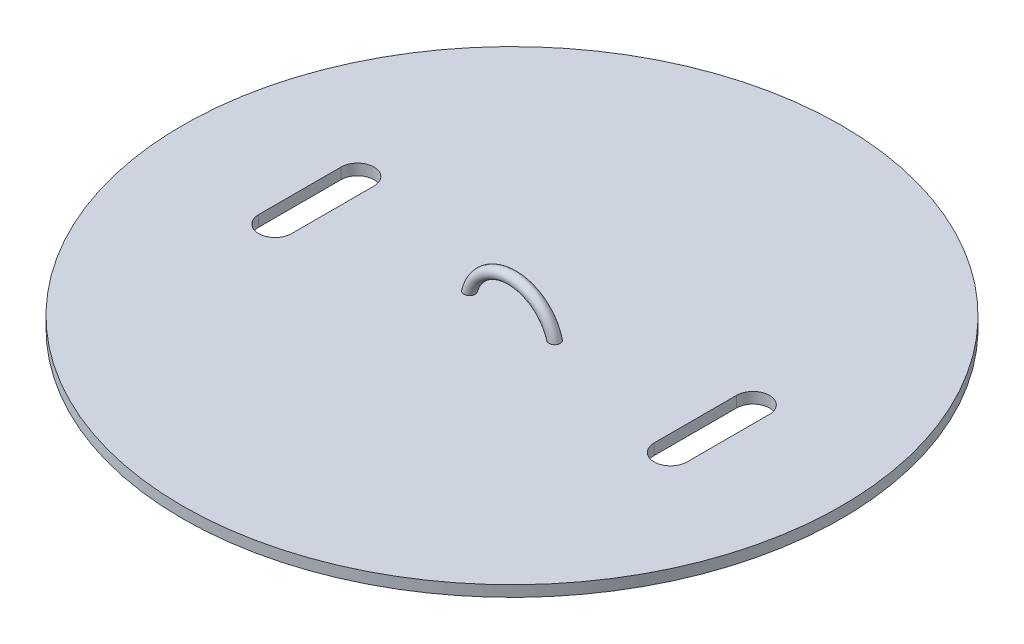
ISO-10303-21;
HEADER;
FILE_DESCRIPTION(('STEP AP214'),'2;1');
FILE_NAME('part.step','',(''),(''),'','','');
FILE_SCHEMA(('AUTOMOTIVE_DESIGN { 1 0 10303 214 1 1 1 1 }'));
ENDSEC;
DATA;
#1=APPLICATION_CONTEXT('core data for automotive mechanical design processes');
#2=APPLICATION_PROTOCOL_DEFINITION('international standard','automotive_design',2000,#1);
#3=PRODUCT_CONTEXT('',#1,'mechanical');
#4=PRODUCT('Part','Part','',(#3));
#5=PRODUCT_RELATED_PRODUCT_CATEGORY('part','',(#4));
#6=PRODUCT_DEFINITION_FORMATION('','',#4);
#7=PRODUCT_DEFINITION_CONTEXT('part definition',#1,'design');
#8=PRODUCT_DEFINITION('design','',#6,#7);
#9=PRODUCT_DEFINITION_SHAPE('','',#8);
#10=(LENGTH_UNIT() NAMED_UNIT(*) SI_UNIT(.MILLI.,.METRE.));
#11=(NAMED_UNIT(*) PLANE_ANGLE_UNIT() SI_UNIT($,.RADIAN.));
#12=(NAMED_UNIT(*) SI_UNIT($,.STERADIAN.) SOLID_ANGLE_UNIT());
#13=UNCERTAINTY_MEASURE_WITH_UNIT(LENGTH_MEASURE(1.E-05),#10,'distance_accuracy_value','');
#14=(GEOMETRIC_REPRESENTATION_CONTEXT(3) GLOBAL_UNCERTAINTY_ASSIGNED_CONTEXT((#13)) GLOBAL_UNIT_ASSIGNED_CONTEXT((#10,
#11,#12)) REPRESENTATION_CONTEXT('',''));
#15=CARTESIAN_POINT('',(0.,0.,0.));
#16=DIRECTION('',(0.,0.,1.));
#17=DIRECTION('',(1.,0.,0.));
#18=AXIS2_PLACEMENT_3D('',#15,#16,#17);
#19=CARTESIAN_POINT('',(0.,2.,137.725986214179));
#20=DIRECTION('',(0.,1.,0.));
#21=DIRECTION('',(0.,0.,1.));
#22=AXIS2_PLACEMENT_3D('',#19,#20,#21);
#23=PLANE('',#22);
#24=CARTESIAN_POINT('',(36.,2.,129.850097305786));
#25=DIRECTION('',(0.,1.,0.));
#26=DIRECTION('',(0.,0.,1.));
#27=AXIS2_PLACEMENT_3D('',#24,#25,#26);
#28=CIRCLE('',#27,3.);
#29=CARTESIAN_POINT('',(39.,2.,129.850097305786));
#30=VERTEX_POINT('',#29);
#31=CARTESIAN_POINT('',(33.,2.,129.850097305786));
#32=VERTEX_POINT('',#31);
#33=EDGE_CURVE('E50',#30,#32,#28,.T.);
#34=ORIENTED_EDGE('',*,*,#33,.F.);
#35=DIRECTION('',(0.,0.,-1.));
#36=VECTOR('',#35,1.);
#37=CARTESIAN_POINT('',(39.,2.,129.850097305786));
#38=LINE('',#37,#36);
#39=CARTESIAN_POINT('',(39.,2.,144.850097305786));
#40=VERTEX_POINT('',#39);
#41=EDGE_CURVE('E123',#40,#30,#38,.T.);
#42=ORIENTED_EDGE('',*,*,#41,.F.);
#43=CARTESIAN_POINT('',(36.,2.,144.850097305786));
#44=DIRECTION('',(0.,1.,0.));
#45=DIRECTION('',(0.,0.,1.));
#46=AXIS2_PLACEMENT_3D('',#43,#44,#45);
#47=CIRCLE('',#46,3.);
#48=CARTESIAN_POINT('',(33.,2.,144.850097305786));
#49=VERTEX_POINT('',#48);
#50=EDGE_CURVE('E107',#49,#40,#47,.T.);
#51=ORIENTED_EDGE('',*,*,#50,.F.);
#52=DIRECTION('',(0.,0.,1.));
#53=VECTOR('',#52,1.);
#54=CARTESIAN_POINT('',(33.,2.,129.850097305786));
#55=LINE('',#54,#53);
#56=EDGE_CURVE('E117',#32,#49,#55,.T.);
#57=ORIENTED_EDGE('',*,*,#56,.F.);
#58=EDGE_LOOP('',(#34,#42,#51,#57));
#59=FACE_BOUND('',#58,.T.);
#60=CARTESIAN_POINT('',(-36.,2.,129.850097305786));
#61=DIRECTION('',(0.,1.,0.));
#62=DIRECTION('',(0.,0.,-1.));
#63=AXIS2_PLACEMENT_3D('',#60,#61,#62);
#64=CIRCLE('',#63,3.);
#65=CARTESIAN_POINT('',(-33.,2.,129.850097305786));
#66=VERTEX_POINT('',#65);
#67=CARTESIAN_POINT('',(-39.,2.,129.850097305786));
#68=VERTEX_POINT('',#67);
#69=EDGE_CURVE('E58',#66,#68,#64,.T.);
#70=ORIENTED_EDGE('',*,*,#69,.F.);
#71=DIRECTION('',(0.,0.,-1.));
#72=VECTOR('',#71,1.);
#73=CARTESIAN_POINT('',(-33.,2.,129.850097305786));
#74=LINE('',#73,#72);
#75=CARTESIAN_POINT('',(-33.,2.,144.850097305786));
#76=VERTEX_POINT('',#75);
#77=EDGE_CURVE('E140',#76,#66,#74,.T.);
#78=ORIENTED_EDGE('',*,*,#77,.F.);
#79=CARTESIAN_POINT('',(-36.,2.,144.850097305786));
#80=DIRECTION('',(0.,1.,0.));
#81=DIRECTION('',(0.,0.,-1.));
#82=AXIS2_PLACEMENT_3D('',#79,#80,#81);
#83=CIRCLE('',#82,3.);
#84=CARTESIAN_POINT('',(-39.,2.,144.850097305786));
#85=VERTEX_POINT('',#84);
#86=EDGE_CURVE('E137',#85,#76,#83,.T.);
#87=ORIENTED_EDGE('',*,*,#86,.F.);
#88=DIRECTION('',(0.,0.,1.));
#89=VECTOR('',#88,1.);
#90=CARTESIAN_POINT('',(-39.,2.,129.850097305786));
#91=LINE('',#90,#89);
#92=EDGE_CURVE('E134',#68,#85,#91,.T.);
#93=ORIENTED_EDGE('',*,*,#92,.F.);
#94=EDGE_LOOP('',(#70,#78,#87,#93));
#95=FACE_BOUND('',#94,.T.);
#96=CARTESIAN_POINT('',(6.7811488769525,2.,137.358591346434));
#97=CARTESIAN_POINT('',(6.80267469490522,2.,137.306332251775));
#98=CARTESIAN_POINT('',(6.82876437892914,2.,137.255898919187));
#99=CARTESIAN_POINT('',(6.88914822352741,2.,137.160143898287));
#100=CARTESIAN_POINT('',(6.92345565618152,2.,137.114830655224));
#101=CARTESIAN_POINT('',(6.99904799460352,2.,137.030635512573));
#102=CARTESIAN_POINT('',(7.04031790363851,2.,136.991740138138));
#103=CARTESIAN_POINT('',(7.12862316130927,2.,136.921209520824));
#104=CARTESIAN_POINT('',(7.17565710576878,2.,136.889572515107));
#105=CARTESIAN_POINT('',(7.27560300601597,2.,136.833460085979));
#106=CARTESIAN_POINT('',(7.32864479411864,2.,136.809215905615));
#107=CARTESIAN_POINT('',(7.4379779802226,2.,136.769707550683));
#108=CARTESIAN_POINT('',(7.49427003615429,2.,136.754445201296));
#109=CARTESIAN_POINT('',(7.61012410310729,2.,136.732984643997));
#110=CARTESIAN_POINT('',(7.66973332112787,2.,136.727040450831));
#111=CARTESIAN_POINT('',(7.78911116622871,2.,136.725188571014));
#112=CARTESIAN_POINT('',(7.84887980243135,2.,136.729281471582));
#113=CARTESIAN_POINT('',(7.96716444197752,2.,136.747496947115));
#114=CARTESIAN_POINT('',(8.02567318942763,2.,136.761666836477));
#115=CARTESIAN_POINT('',(8.13941835402063,2.,136.799784442725));
#116=CARTESIAN_POINT('',(8.19465498697862,2.,136.823731513924));
#117=CARTESIAN_POINT('',(8.29932815549681,2.,136.880367220211));
#118=CARTESIAN_POINT('',(8.34884238897097,2.,136.912912121802));
#119=CARTESIAN_POINT('',(8.44150943051888,2.,136.986065458279));
#120=CARTESIAN_POINT('',(8.48466314710946,2.,137.02667273961));
#121=CARTESIAN_POINT('',(8.56214814372743,2.,137.113641276871));
#122=CARTESIAN_POINT('',(8.59668391159617,2.,137.159820326533));
#123=CARTESIAN_POINT('',(8.65726699343681,2.,137.257447243504));
#124=CARTESIAN_POINT('',(8.68331563884757,2.,137.308894282719));
#125=CARTESIAN_POINT('',(8.72549323792427,2.,137.414151792032));
#126=CARTESIAN_POINT('',(8.74186247612141,2.,137.467866045654));
#127=CARTESIAN_POINT('',(8.76518177445051,2.,137.577300778838));
#128=CARTESIAN_POINT('',(8.77213287016206,2.,137.633021037137));
#129=CARTESIAN_POINT('',(8.77635157705661,2.,137.743906840947));
#130=CARTESIAN_POINT('',(8.77377631667825,2.,137.79906647178));
#131=CARTESIAN_POINT('',(8.7593767519,2.,137.908162550967));
#132=CARTESIAN_POINT('',(8.74755278049773,2.,137.962099043286));
#133=CARTESIAN_POINT('',(8.71507274343592,2.,138.067104370129));
#134=CARTESIAN_POINT('',(8.69443691443072,2.,138.118179473743));
#135=CARTESIAN_POINT('',(8.64498223307623,2.,138.21619737075));
#136=CARTESIAN_POINT('',(8.6161630529515,2.,138.263139998523));
#137=CARTESIAN_POINT('',(8.55082070920462,2.,138.35219244588));
#138=CARTESIAN_POINT('',(8.51420854370895,2.,138.394236912983));
#139=CARTESIAN_POINT('',(8.43458822977717,2.,138.4717515669));
#140=CARTESIAN_POINT('',(8.39157943675617,2.,138.507221090349));
#141=CARTESIAN_POINT('',(8.29934223173324,2.,138.571463495852));
#142=CARTESIAN_POINT('',(8.24999352527523,2.,138.600063601847));
#143=CARTESIAN_POINT('',(8.14729127765814,2.,138.6488241079));
#144=CARTESIAN_POINT('',(8.09393719071489,2.,138.668983355313));
#145=CARTESIAN_POINT('',(7.98319296155033,2.,138.700857154021));
#146=CARTESIAN_POINT('',(7.9257325975508,2.,138.712327811438));
#147=CARTESIAN_POINT('',(7.80970780391378,2.,138.725685019721));
#148=CARTESIAN_POINT('',(7.75114322889932,2.,138.727570299636));
#149=CARTESIAN_POINT('',(7.63322353669025,2.,138.721689990014));
#150=CARTESIAN_POINT('',(7.57387881141164,2.,138.713714260085));
#151=CARTESIAN_POINT('',(7.45734650418845,2.,138.687974580524));
#152=CARTESIAN_POINT('',(7.40015909276884,2.,138.670209858845));
#153=CARTESIAN_POINT('',(7.28926471943639,2.,138.625205692979));
#154=CARTESIAN_POINT('',(7.23557882748502,2.,138.597914229424));
#155=CARTESIAN_POINT('',(7.13365633049953,2.,138.534552704852));
#156=CARTESIAN_POINT('',(7.08541941858052,2.,138.498483138576));
#157=CARTESIAN_POINT('',(6.99673829428325,2.,138.419202896442));
#158=CARTESIAN_POINT('',(6.95617178424017,2.,138.376129198509));
#159=CARTESIAN_POINT('',(6.88317776826002,2.,138.28356181094));
#160=CARTESIAN_POINT('',(6.85074812932011,2.,138.234069808971));
#161=CARTESIAN_POINT('',(6.79623532452874,2.,138.132002366074));
#162=CARTESIAN_POINT('',(6.77381713647309,2.,138.07960589382));
#163=CARTESIAN_POINT('',(6.73846921063265,2.,137.971688186171));
#164=CARTESIAN_POINT('',(6.72553967893498,2.,137.916166882934));
#165=CARTESIAN_POINT('',(6.70996215548475,2.,137.805741583652));
#166=CARTESIAN_POINT('',(6.70696223712448,2.,137.750886796658));
#167=CARTESIAN_POINT('',(6.71037135351239,2.,137.641522328461));
#168=CARTESIAN_POINT('',(6.71676706124414,2.,137.587012268376));
#169=CARTESIAN_POINT('',(6.73383893506642,2.,137.503569799327));
#170=CARTESIAN_POINT('',(6.74138240851339,2.,137.473961464036));
#171=CARTESIAN_POINT('',(6.75922296959793,2.,137.415588275328));
#172=CARTESIAN_POINT('',(6.76951993951754,2.,137.38682338591));
#173=CARTESIAN_POINT('',(6.7811488769525,2.,137.358591346434));
#174=B_SPLINE_CURVE_WITH_KNOTS('',3,(#96,#97,#98,#99,#100,#101,#102,#103,#104,#105,#106,#107,
#108,#109,#110,#111,#112,#113,#114,#115,#116,#117,#118,#119,#120,#121,#122,#123,#124,#125,#126,
#127,#128,#129,#130,#131,#132,#133,#134,#135,#136,#137,#138,#139,#140,#141,#142,#143,#144,#145,
#146,#147,#148,#149,#150,#151,#152,#153,#154,#155,#156,#157,#158,#159,#160,#161,#162,#163,#164,
#165,#166,#167,#168,#169,#170,#171,#172,#173),.UNSPECIFIED.,.T.,.F.,(4,2,2,2,2,2,2,2,2,2,2,2,2,
2,2,2,2,2,2,2,2,2,2,2,2,2,2,2,2,2,2,2,2,2,2,2,2,2,4),(0.,0.169439588197158,0.339154697242677,
0.508508811855664,0.677821751831039,0.851987306307318,1.02618824042224,1.20506011677158,
1.38394245823628,1.56367029739307,1.74338626921827,1.9202695665986,2.0971275739725,
2.26927180980235,2.44138902705132,2.60903156981148,2.77665567780183,2.94152740233385,
3.10639319097247,3.27088238033352,3.43537815906428,3.60186440924839,3.76836744754811,
3.93869985437654,4.10905551344332,4.28403205214263,4.45903179083244,4.63782594494291,
4.81663420235776,4.9964344958794,5.1762246580497,5.35284791659241,5.52942482655229,
5.69954383301023,5.86966653422721,6.0336912327109,6.19748349854114,6.28902411286724,
6.3805608142589),.UNSPECIFIED.);
#175=CARTESIAN_POINT('',(6.7811488769525,2.,137.358591346434));
#176=VERTEX_POINT('',#175);
#177=EDGE_CURVE('E130',#176,#176,#174,.T.);
#178=ORIENTED_EDGE('',*,*,#177,.T.);
#179=EDGE_LOOP('',(#178));
#180=FACE_BOUND('',#179,.T.);
#181=CARTESIAN_POINT('',(0.,2.,137.725986214179));
#182=DIRECTION('',(0.,1.,0.));
#183=DIRECTION('',(0.,0.,1.));
#184=AXIS2_PLACEMENT_3D('',#181,#182,#183);
#185=CIRCLE('',#184,60.);
#186=CARTESIAN_POINT('',(0.,2.,197.725986214179));
#187=VERTEX_POINT('',#186);
#188=EDGE_CURVE('E210',#187,#187,#185,.T.);
#189=ORIENTED_EDGE('',*,*,#188,.T.);
#190=EDGE_LOOP('',(#189));
#191=FACE_BOUND('',#190,.T.);
#192=CARTESIAN_POINT('',(-8.65660578742365,2.,137.259711096164));
#193=CARTESIAN_POINT('',(-8.6296439664818,2.,137.209876808441));
#194=CARTESIAN_POINT('',(-8.59837084144046,2.,137.162320907217));
#195=CARTESIAN_POINT('',(-8.52820377126143,2.,137.073141030814));
#196=CARTESIAN_POINT('',(-8.48929867858418,2.,137.031525888419));
#197=CARTESIAN_POINT('',(-8.40515354582068,2.,136.955437194678));
#198=CARTESIAN_POINT('',(-8.35992367768744,2.,136.920952392291));
#199=CARTESIAN_POINT('',(-8.2644285130205,2.,136.859903472062));
#200=CARTESIAN_POINT('',(-8.21416444016854,2.,136.833337435589));
#201=CARTESIAN_POINT('',(-8.10895243220787,2.,136.788267570775));
#202=CARTESIAN_POINT('',(-8.05393097040182,2.,136.769935459745));
#203=CARTESIAN_POINT('',(-7.94162852371837,2.,136.742515346182));
#204=CARTESIAN_POINT('',(-7.8843471287052,2.,136.733429029679));
#205=CARTESIAN_POINT('',(-7.76762059979749,2.,136.724558371035));
#206=CARTESIAN_POINT('',(-7.70815723197797,2.,136.72501306914));
#207=CARTESIAN_POINT('',(-7.59012328237744,2.,136.735761178949));
#208=CARTESIAN_POINT('',(-7.53155279539606,2.,136.746055628077));
#209=CARTESIAN_POINT('',(-7.41618795227273,2.,136.776410662372));
#210=CARTESIAN_POINT('',(-7.35942608984092,2.,136.796595040004));
#211=CARTESIAN_POINT('',(-7.25013276312909,2.,136.846283975809));
#212=CARTESIAN_POINT('',(-7.19760129872426,2.,136.875788533706));
#213=CARTESIAN_POINT('',(-7.09880044744566,2.,136.943090953372));
#214=CARTESIAN_POINT('',(-7.05248131099334,2.,136.980815670159));
#215=CARTESIAN_POINT('',(-6.96708283152867,2.,137.063729886007));
#216=CARTESIAN_POINT('',(-6.92800230345426,2.,137.108918160882));
#217=CARTESIAN_POINT('',(-6.85952858634192,2.,137.204013920567));
#218=CARTESIAN_POINT('',(-6.82987384752107,2.,137.253732925361));
#219=CARTESIAN_POINT('',(-6.77972948141965,2.,137.357596566686));
#220=CARTESIAN_POINT('',(-6.75923744101055,2.,137.411740033522));
#221=CARTESIAN_POINT('',(-6.72881796247374,2.,137.520625026855));
#222=CARTESIAN_POINT('',(-6.71850743762457,2.,137.575259670633));
#223=CARTESIAN_POINT('',(-6.70746167620176,2.,137.685485529294));
#224=CARTESIAN_POINT('',(-6.70672478063162,2.,137.741076576772));
#225=CARTESIAN_POINT('',(-6.71475066874299,2.,137.850193596323));
#226=CARTESIAN_POINT('',(-6.72328158942937,2.,137.903736824512));
#227=CARTESIAN_POINT('',(-6.74916788453375,2.,138.008641129814));
#228=CARTESIAN_POINT('',(-6.7665232466783,2.,138.060002209962));
#229=CARTESIAN_POINT('',(-6.809571986113,2.,138.159418208009));
#230=CARTESIAN_POINT('',(-6.83530907158335,2.,138.207454158525));
#231=CARTESIAN_POINT('',(-6.89425240683259,2.,138.298696004617));
#232=CARTESIAN_POINT('',(-6.92745964495923,2.,138.341901259928));
#233=CARTESIAN_POINT('',(-7.00146224982255,2.,138.423694321627));
#234=CARTESIAN_POINT('',(-7.04245948471955,2.,138.462099376425));
#235=CARTESIAN_POINT('',(-7.13011254114761,2.,138.531789221468));
#236=CARTESIAN_POINT('',(-7.17676942609062,2.,138.563072670423));
#237=CARTESIAN_POINT('',(-7.27633179930554,2.,138.618870701714));
#238=CARTESIAN_POINT('',(-7.32940792076456,2.,138.643080994574));
#239=CARTESIAN_POINT('',(-7.4388014475135,2.,138.68251299866));
#240=CARTESIAN_POINT('',(-7.49511936510006,2.,138.697733284904));
#241=CARTESIAN_POINT('',(-7.61100718875926,2.,138.719100592779));
#242=CARTESIAN_POINT('',(-7.67062375158781,2.,138.724995412412));
#243=CARTESIAN_POINT('',(-7.7900077929678,2.,138.726747389981));
#244=CARTESIAN_POINT('',(-7.84977527991169,2.,138.72260397687));
#245=CARTESIAN_POINT('',(-7.96804551886426,2.,138.704287870989));
#246=CARTESIAN_POINT('',(-8.02654106344569,2.,138.690068444716));
#247=CARTESIAN_POINT('',(-8.14025169448835,2.,138.651854235727));
#248=CARTESIAN_POINT('',(-8.19546698043613,2.,138.627860048156));
#249=CARTESIAN_POINT('',(-8.30008738031459,2.,138.571135982741));
#250=CARTESIAN_POINT('',(-8.34957053478581,2.,138.538550174221));
#251=CARTESIAN_POINT('',(-8.44216870829997,2.,138.465320896051));
#252=CARTESIAN_POINT('',(-8.48528463806351,2.,138.424678580697));
#253=CARTESIAN_POINT('',(-8.56268982636776,2.,138.33764762088));
#254=CARTESIAN_POINT('',(-8.59718366358837,2.,138.29144094457));
#255=CARTESIAN_POINT('',(-8.65767740486952,2.,138.193768279647));
#256=CARTESIAN_POINT('',(-8.68367898601453,2.,138.142303332096));
#257=CARTESIAN_POINT('',(-8.72575997702568,2.,138.037024489222));
#258=CARTESIAN_POINT('',(-8.74208057779969,2.,137.983306921529));
#259=CARTESIAN_POINT('',(-8.76530669978141,2.,137.873858067868));
#260=CARTESIAN_POINT('',(-8.77221076311529,2.,137.818126471459));
#261=CARTESIAN_POINT('',(-8.77633793883065,2.,137.707202376772));
#262=CARTESIAN_POINT('',(-8.77371314369357,2.,137.652015384716));
#263=CARTESIAN_POINT('',(-8.75920453585633,2.,137.542923283018));
#264=CARTESIAN_POINT('',(-8.74733287603514,2.,137.489016586476));
#265=CARTESIAN_POINT('',(-8.72156010491991,2.,137.405928054008));
#266=CARTESIAN_POINT('',(-8.71057065561322,2.,137.375811479273));
#267=CARTESIAN_POINT('',(-8.68571542283042,2.,137.31679087643));
#268=CARTESIAN_POINT('',(-8.67184968971035,2.,137.287886827106));
#269=CARTESIAN_POINT('',(-8.65660578742365,2.,137.259711096164));
#270=B_SPLINE_CURVE_WITH_KNOTS('',3,(#192,#193,#194,#195,#196,#197,#198,#199,#200,#201,#202,
#203,#204,#205,#206,#207,#208,#209,#210,#211,#212,#213,#214,#215,#216,#217,#218,#219,#220,#221,
#222,#223,#224,#225,#226,#227,#228,#229,#230,#231,#232,#233,#234,#235,#236,#237,#238,#239,#240,
#241,#242,#243,#244,#245,#246,#247,#248,#249,#250,#251,#252,#253,#254,#255,#256,#257,#258,#259,
#260,#261,#262,#263,#264,#265,#266,#267,#268,#269),.UNSPECIFIED.,.T.,.F.,(4,2,2,2,2,2,2,2,2,2,2,
2,2,2,2,2,2,2,2,2,2,2,2,2,2,2,2,2,2,2,2,2,2,2,2,2,2,2,4),(0.,0.169860450047182,
0.339970877246089,0.509810801719611,0.67960954234427,0.852801405605253,1.02602484586228,
1.20359328703284,1.38118045164478,1.56104956389233,1.74091867083373,1.91924825369884,
2.09754861564669,2.27035112657193,2.44310810062399,2.60908445312348,2.77503204350457,
2.93692157779831,3.0988108869293,3.2615582930245,3.4243272442931,3.59209936645869,
3.7599030609011,3.9341181153257,4.10836077670717,4.28723977194299,4.46612894334177,
4.64585329674545,4.82556670913058,5.00243959889,5.17928716550915,5.35142256264398,
5.52352394521296,5.69113479229474,5.85877158604134,6.02374453559673,6.18850103121035,
6.28453984987143,6.38057698729167),.UNSPECIFIED.);
#271=CARTESIAN_POINT('',(-8.65660578742365,2.,137.259711096164));
#272=VERTEX_POINT('',#271);
#273=EDGE_CURVE('E158',#272,#272,#270,.T.);
#274=ORIENTED_EDGE('',*,*,#273,.T.);
#275=EDGE_LOOP('',(#274));
#276=FACE_BOUND('',#275,.T.);
#277=ADVANCED_FACE('F35',(#59,#95,#180,#191,#276),#23,.T.);
#278=CARTESIAN_POINT('',(0.,2.,137.725986214179));
#279=DIRECTION('',(0.,-1.,0.));
#280=DIRECTION('',(0.,0.,-1.));
#281=AXIS2_PLACEMENT_3D('',#278,#279,#280);
#282=CYLINDRICAL_SURFACE('',#281,60.);
#283=ORIENTED_EDGE('',*,*,#188,.F.);
#284=EDGE_LOOP('',(#283));
#285=FACE_BOUND('',#284,.T.);
#286=CARTESIAN_POINT('',(0.,0.,137.725986214179));
#287=DIRECTION('',(0.,1.,0.));
#288=DIRECTION('',(0.,0.,1.));
#289=AXIS2_PLACEMENT_3D('',#286,#287,#288);
#290=CIRCLE('',#289,60.);
#291=CARTESIAN_POINT('',(0.,0.,197.725986214179));
#292=VERTEX_POINT('',#291);
#293=EDGE_CURVE('E213',#292,#292,#290,.T.);
#294=ORIENTED_EDGE('',*,*,#293,.T.);
#295=EDGE_LOOP('',(#294));
#296=FACE_BOUND('',#295,.T.);
#297=ADVANCED_FACE('F37',(#285,#296),#282,.T.);
#298=CARTESIAN_POINT('',(0.,0.,137.725986214179));
#299=DIRECTION('',(0.,1.,0.));
#300=DIRECTION('',(0.,0.,1.));
#301=AXIS2_PLACEMENT_3D('',#298,#299,#300);
#302=PLANE('',#301);
#303=DIRECTION('',(0.,0.,-1.));
#304=VECTOR('',#303,1.);
#305=CARTESIAN_POINT('',(39.,0.,137.725986214179));
#306=LINE('',#305,#304);
#307=CARTESIAN_POINT('',(39.,0.,144.850097305786));
#308=VERTEX_POINT('',#307);
#309=CARTESIAN_POINT('',(39.,0.,129.850097305786));
#310=VERTEX_POINT('',#309);
#311=EDGE_CURVE('E43',#308,#310,#306,.T.);
#312=ORIENTED_EDGE('',*,*,#311,.T.);
#313=CARTESIAN_POINT('',(36.,0.,129.850097305786));
#314=DIRECTION('',(0.,1.,0.));
#315=DIRECTION('',(0.,0.,1.));
#316=AXIS2_PLACEMENT_3D('',#313,#314,#315);
#317=CIRCLE('',#316,3.);
#318=CARTESIAN_POINT('',(33.,0.,129.850097305786));
#319=VERTEX_POINT('',#318);
#320=EDGE_CURVE('E11',#310,#319,#317,.T.);
#321=ORIENTED_EDGE('',*,*,#320,.T.);
#322=DIRECTION('',(0.,0.,1.));
#323=VECTOR('',#322,1.);
#324=CARTESIAN_POINT('',(33.,0.,137.725986214179));
#325=LINE('',#324,#323);
#326=CARTESIAN_POINT('',(33.,0.,144.850097305786));
#327=VERTEX_POINT('',#326);
#328=EDGE_CURVE('E230',#319,#327,#325,.T.);
#329=ORIENTED_EDGE('',*,*,#328,.T.);
#330=CARTESIAN_POINT('',(36.,0.,144.850097305786));
#331=DIRECTION('',(0.,1.,0.));
#332=DIRECTION('',(0.,0.,1.));
#333=AXIS2_PLACEMENT_3D('',#330,#331,#332);
#334=CIRCLE('',#333,3.);
#335=EDGE_CURVE('E110',#327,#308,#334,.T.);
#336=ORIENTED_EDGE('',*,*,#335,.T.);
#337=EDGE_LOOP('',(#312,#321,#329,#336));
#338=FACE_BOUND('',#337,.T.);
#339=DIRECTION('',(0.,0.,-1.));
#340=VECTOR('',#339,1.);
#341=CARTESIAN_POINT('',(-33.,0.,137.725986214179));
#342=LINE('',#341,#340);
#343=CARTESIAN_POINT('',(-33.,0.,144.850097305786));
#344=VERTEX_POINT('',#343);
#345=CARTESIAN_POINT('',(-33.,0.,129.850097305786));
#346=VERTEX_POINT('',#345);
#347=EDGE_CURVE('E224',#344,#346,#342,.T.);
#348=ORIENTED_EDGE('',*,*,#347,.T.);
#349=CARTESIAN_POINT('',(-36.,0.,129.850097305786));
#350=DIRECTION('',(0.,1.,0.));
#351=DIRECTION('',(0.,0.,1.));
#352=AXIS2_PLACEMENT_3D('',#349,#350,#351);
#353=CIRCLE('',#352,3.);
#354=CARTESIAN_POINT('',(-39.,0.,129.850097305786));
#355=VERTEX_POINT('',#354);
#356=EDGE_CURVE('E227',#346,#355,#353,.T.);
#357=ORIENTED_EDGE('',*,*,#356,.T.);
#358=DIRECTION('',(0.,0.,1.));
#359=VECTOR('',#358,1.);
#360=CARTESIAN_POINT('',(-39.,0.,137.725986214179));
#361=LINE('',#360,#359);
#362=CARTESIAN_POINT('',(-39.,0.,144.850097305786));
#363=VERTEX_POINT('',#362);
#364=EDGE_CURVE('E216',#355,#363,#361,.T.);
#365=ORIENTED_EDGE('',*,*,#364,.T.);
#366=CARTESIAN_POINT('',(-36.,0.,144.850097305786));
#367=DIRECTION('',(0.,1.,0.));
#368=DIRECTION('',(0.,0.,1.));
#369=AXIS2_PLACEMENT_3D('',#366,#367,#368);
#370=CIRCLE('',#369,3.);
#371=EDGE_CURVE('E221',#363,#344,#370,.T.);
#372=ORIENTED_EDGE('',*,*,#371,.T.);
#373=EDGE_LOOP('',(#348,#357,#365,#372));
#374=FACE_BOUND('',#373,.T.);
#375=ORIENTED_EDGE('',*,*,#293,.F.);
#376=EDGE_LOOP('',(#375));
#377=FACE_BOUND('',#376,.T.);
#378=ADVANCED_FACE('F169',(#338,#374,#377),#302,.F.);
#379=CARTESIAN_POINT('',(0.,0.,137.725986214179));
#380=DIRECTION('',(0.,0.,-1.));
#381=DIRECTION('',(-1.,0.,0.));
#382=AXIS2_PLACEMENT_3D('',#379,#380,#381);
#383=TOROIDAL_SURFACE('',#382,8.,1.);
#384=ORIENTED_EDGE('',*,*,#273,.F.);
#385=EDGE_LOOP('',(#384));
#386=FACE_BOUND('',#385,.T.);
#387=ORIENTED_EDGE('',*,*,#177,.F.);
#388=EDGE_LOOP('',(#387));
#389=FACE_BOUND('',#388,.T.);
#390=ADVANCED_FACE('F164',(#386,#389),#383,.T.);
#391=CARTESIAN_POINT('',(-36.,-8.,129.850097305786));
#392=DIRECTION('',(0.,1.,0.));
#393=DIRECTION('',(0.,0.,1.));
#394=AXIS2_PLACEMENT_3D('',#391,#392,#393);
#395=CYLINDRICAL_SURFACE('',#394,3.);
#396=DIRECTION('',(0.,1.,0.));
#397=VECTOR('',#396,1.);
#398=CARTESIAN_POINT('',(-33.,-8.,129.850097305786));
#399=LINE('',#398,#397);
#400=EDGE_CURVE('E144',#346,#66,#399,.T.);
#401=ORIENTED_EDGE('',*,*,#400,.T.);
#402=ORIENTED_EDGE('',*,*,#69,.T.);
#403=DIRECTION('',(0.,1.,0.));
#404=VECTOR('',#403,1.);
#405=CARTESIAN_POINT('',(-39.,-8.,129.850097305786));
#406=LINE('',#405,#404);
#407=EDGE_CURVE('E143',#355,#68,#406,.T.);
#408=ORIENTED_EDGE('',*,*,#407,.F.);
#409=ORIENTED_EDGE('',*,*,#356,.F.);
#410=EDGE_LOOP('',(#401,#402,#408,#409));
#411=FACE_BOUND('',#410,.T.);
#412=ADVANCED_FACE('F168',(#411),#395,.F.);
#413=CARTESIAN_POINT('',(-33.,-8.,129.850097305786));
#414=DIRECTION('',(1.,0.,0.));
#415=DIRECTION('',(0.,0.,-1.));
#416=AXIS2_PLACEMENT_3D('',#413,#414,#415);
#417=PLANE('',#416);
#418=DIRECTION('',(0.,1.,0.));
#419=VECTOR('',#418,1.);
#420=CARTESIAN_POINT('',(-33.,-8.,144.850097305786));
#421=LINE('',#420,#419);
#422=EDGE_CURVE('E146',#344,#76,#421,.T.);
#423=ORIENTED_EDGE('',*,*,#422,.T.);
#424=ORIENTED_EDGE('',*,*,#77,.T.);
#425=ORIENTED_EDGE('',*,*,#400,.F.);
#426=ORIENTED_EDGE('',*,*,#347,.F.);
#427=EDGE_LOOP('',(#423,#424,#425,#426));
#428=FACE_BOUND('',#427,.T.);
#429=ADVANCED_FACE('F174',(#428),#417,.F.);
#430=CARTESIAN_POINT('',(-36.,-8.,144.850097305786));
#431=DIRECTION('',(0.,1.,0.));
#432=DIRECTION('',(0.,0.,1.));
#433=AXIS2_PLACEMENT_3D('',#430,#431,#432);
#434=CYLINDRICAL_SURFACE('',#433,3.);
#435=DIRECTION('',(0.,1.,0.));
#436=VECTOR('',#435,1.);
#437=CARTESIAN_POINT('',(-39.,-8.,144.850097305786));
#438=LINE('',#437,#436);
#439=EDGE_CURVE('E148',#363,#85,#438,.T.);
#440=ORIENTED_EDGE('',*,*,#439,.T.);
#441=ORIENTED_EDGE('',*,*,#86,.T.);
#442=ORIENTED_EDGE('',*,*,#422,.F.);
#443=ORIENTED_EDGE('',*,*,#371,.F.);
#444=EDGE_LOOP('',(#440,#441,#442,#443));
#445=FACE_BOUND('',#444,.T.);
#446=ADVANCED_FACE('F179',(#445),#434,.F.);
#447=CARTESIAN_POINT('',(-39.,-8.,129.850097305786));
#448=DIRECTION('',(-1.,0.,0.));
#449=DIRECTION('',(0.,0.,1.));
#450=AXIS2_PLACEMENT_3D('',#447,#448,#449);
#451=PLANE('',#450);
#452=ORIENTED_EDGE('',*,*,#407,.T.);
#453=ORIENTED_EDGE('',*,*,#92,.T.);
#454=ORIENTED_EDGE('',*,*,#439,.F.);
#455=ORIENTED_EDGE('',*,*,#364,.F.);
#456=EDGE_LOOP('',(#452,#453,#454,#455));
#457=FACE_BOUND('',#456,.T.);
#458=ADVANCED_FACE('F175',(#457),#451,.F.);
#459=CARTESIAN_POINT('',(36.,-8.,129.850097305786));
#460=DIRECTION('',(0.,1.,0.));
#461=DIRECTION('',(0.,0.,1.));
#462=AXIS2_PLACEMENT_3D('',#459,#460,#461);
#463=CYLINDRICAL_SURFACE('',#462,3.);
#464=DIRECTION('',(0.,1.,0.));
#465=VECTOR('',#464,1.);
#466=CARTESIAN_POINT('',(39.,-8.,129.850097305786));
#467=LINE('',#466,#465);
#468=EDGE_CURVE('E128',#310,#30,#467,.T.);
#469=ORIENTED_EDGE('',*,*,#468,.T.);
#470=ORIENTED_EDGE('',*,*,#33,.T.);
#471=DIRECTION('',(0.,1.,0.));
#472=VECTOR('',#471,1.);
#473=CARTESIAN_POINT('',(33.,-8.,129.850097305786));
#474=LINE('',#473,#472);
#475=EDGE_CURVE('E114',#319,#32,#474,.T.);
#476=ORIENTED_EDGE('',*,*,#475,.F.);
#477=ORIENTED_EDGE('',*,*,#320,.F.);
#478=EDGE_LOOP('',(#469,#470,#476,#477));
#479=FACE_BOUND('',#478,.T.);
#480=ADVANCED_FACE('F178',(#479),#463,.F.);
#481=CARTESIAN_POINT('',(39.,-8.,129.850097305786));
#482=DIRECTION('',(1.,0.,0.));
#483=DIRECTION('',(0.,0.,-1.));
#484=AXIS2_PLACEMENT_3D('',#481,#482,#483);
#485=PLANE('',#484);
#486=DIRECTION('',(0.,1.,0.));
#487=VECTOR('',#486,1.);
#488=CARTESIAN_POINT('',(39.,-8.,144.850097305786));
#489=LINE('',#488,#487);
#490=EDGE_CURVE('E113',#308,#40,#489,.T.);
#491=ORIENTED_EDGE('',*,*,#490,.T.);
#492=ORIENTED_EDGE('',*,*,#41,.T.);
#493=ORIENTED_EDGE('',*,*,#468,.F.);
#494=ORIENTED_EDGE('',*,*,#311,.F.);
#495=EDGE_LOOP('',(#491,#492,#493,#494));
#496=FACE_BOUND('',#495,.T.);
#497=ADVANCED_FACE('F189',(#496),#485,.F.);
#498=CARTESIAN_POINT('',(36.,-8.,144.850097305786));
#499=DIRECTION('',(0.,1.,0.));
#500=DIRECTION('',(0.,0.,1.));
#501=AXIS2_PLACEMENT_3D('',#498,#499,#500);
#502=CYLINDRICAL_SURFACE('',#501,3.);
#503=DIRECTION('',(0.,1.,0.));
#504=VECTOR('',#503,1.);
#505=CARTESIAN_POINT('',(33.,-8.,144.850097305786));
#506=LINE('',#505,#504);
#507=EDGE_CURVE('E102',#327,#49,#506,.T.);
#508=ORIENTED_EDGE('',*,*,#507,.T.);
#509=ORIENTED_EDGE('',*,*,#50,.T.);
#510=ORIENTED_EDGE('',*,*,#490,.F.);
#511=ORIENTED_EDGE('',*,*,#335,.F.);
#512=EDGE_LOOP('',(#508,#509,#510,#511));
#513=FACE_BOUND('',#512,.T.);
#514=ADVANCED_FACE('F104',(#513),#502,.F.);
#515=CARTESIAN_POINT('',(33.,-8.,129.850097305786));
#516=DIRECTION('',(-1.,0.,0.));
#517=DIRECTION('',(0.,0.,1.));
#518=AXIS2_PLACEMENT_3D('',#515,#516,#517);
#519=PLANE('',#518);
#520=ORIENTED_EDGE('',*,*,#475,.T.);
#521=ORIENTED_EDGE('',*,*,#56,.T.);
#522=ORIENTED_EDGE('',*,*,#507,.F.);
#523=ORIENTED_EDGE('',*,*,#328,.F.);
#524=EDGE_LOOP('',(#520,#521,#522,#523));
#525=FACE_BOUND('',#524,.T.);
#526=ADVANCED_FACE('F118',(#525),#519,.F.);
#527=CLOSED_SHELL('',(#277,#297,#378,#390,#412,#429,#446,#458,#480,#497,#514,#526));
#528=MANIFOLD_SOLID_BREP('B2',#527);
#529=ADVANCED_BREP_SHAPE_REPRESENTATION('',(#18,#528),#14);
#530=SHAPE_DEFINITION_REPRESENTATION(#9,#529);
ENDSEC;
END-ISO-10303-21;
